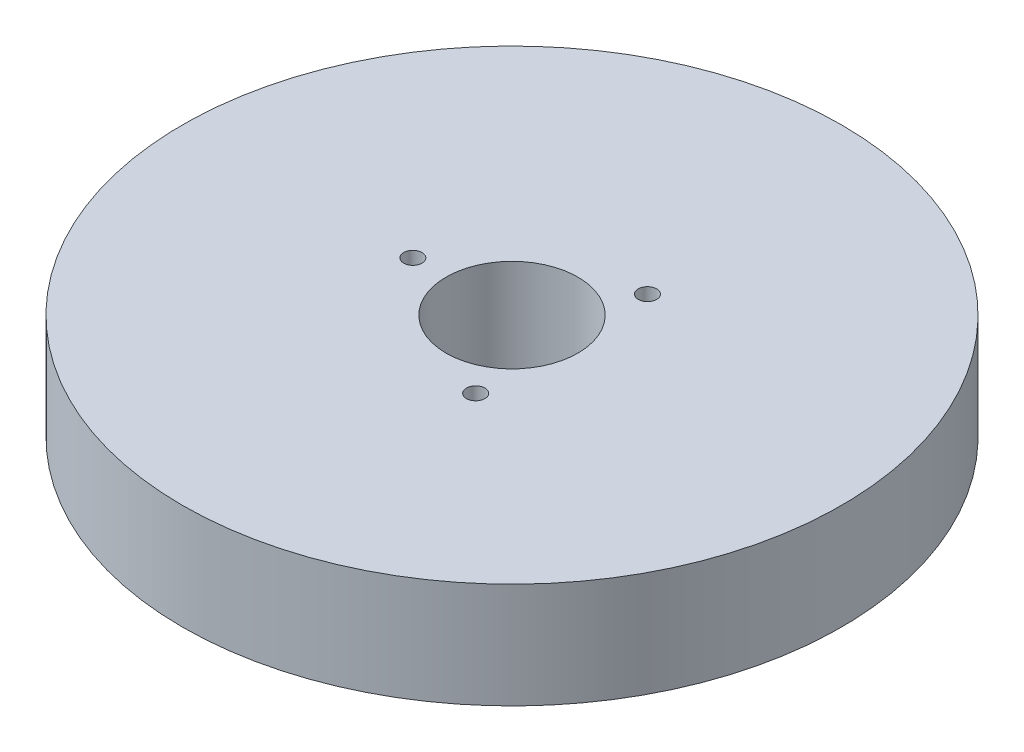
ISO-10303-21;
HEADER;
FILE_DESCRIPTION(('STEP AP214'),'2;1');
FILE_NAME('part.step','',(''),(''),'','','');
FILE_SCHEMA(('AUTOMOTIVE_DESIGN { 1 0 10303 214 1 1 1 1 }'));
ENDSEC;
DATA;
#1=APPLICATION_CONTEXT('core data for automotive mechanical design processes');
#2=APPLICATION_PROTOCOL_DEFINITION('international standard','automotive_design',2000,#1);
#3=PRODUCT_CONTEXT('',#1,'mechanical');
#4=PRODUCT('Part','Part','',(#3));
#5=PRODUCT_RELATED_PRODUCT_CATEGORY('part','',(#4));
#6=PRODUCT_DEFINITION_FORMATION('','',#4);
#7=PRODUCT_DEFINITION_CONTEXT('part definition',#1,'design');
#8=PRODUCT_DEFINITION('design','',#6,#7);
#9=PRODUCT_DEFINITION_SHAPE('','',#8);
#10=(LENGTH_UNIT() NAMED_UNIT(*) SI_UNIT(.MILLI.,.METRE.));
#11=(NAMED_UNIT(*) PLANE_ANGLE_UNIT() SI_UNIT($,.RADIAN.));
#12=(NAMED_UNIT(*) SI_UNIT($,.STERADIAN.) SOLID_ANGLE_UNIT());
#13=UNCERTAINTY_MEASURE_WITH_UNIT(LENGTH_MEASURE(1.E-05),#10,'distance_accuracy_value','');
#14=(GEOMETRIC_REPRESENTATION_CONTEXT(3) GLOBAL_UNCERTAINTY_ASSIGNED_CONTEXT((#13)) GLOBAL_UNIT_ASSIGNED_CONTEXT((#10,
#11,#12)) REPRESENTATION_CONTEXT('',''));
#15=CARTESIAN_POINT('',(0.,0.,0.));
#16=DIRECTION('',(0.,0.,1.));
#17=DIRECTION('',(1.,0.,0.));
#18=AXIS2_PLACEMENT_3D('',#15,#16,#17);
#19=CARTESIAN_POINT('',(0.,24.,0.));
#20=DIRECTION('',(0.,-1.,0.));
#21=DIRECTION('',(0.,0.,-1.));
#22=AXIS2_PLACEMENT_3D('',#19,#20,#21);
#23=CYLINDRICAL_SURFACE('',#22,75.);
#24=CARTESIAN_POINT('',(0.,24.,0.));
#25=DIRECTION('',(0.,1.,0.));
#26=DIRECTION('',(0.,0.,1.));
#27=AXIS2_PLACEMENT_3D('',#24,#25,#26);
#28=CIRCLE('',#27,75.);
#29=CARTESIAN_POINT('',(0.,24.,75.));
#30=VERTEX_POINT('',#29);
#31=EDGE_CURVE('E10',#30,#30,#28,.T.);
#32=ORIENTED_EDGE('',*,*,#31,.F.);
#33=EDGE_LOOP('',(#32));
#34=FACE_BOUND('',#33,.T.);
#35=CARTESIAN_POINT('',(0.,0.,0.));
#36=DIRECTION('',(0.,1.,0.));
#37=DIRECTION('',(0.,0.,1.));
#38=AXIS2_PLACEMENT_3D('',#35,#36,#37);
#39=CIRCLE('',#38,75.);
#40=CARTESIAN_POINT('',(0.,0.,75.));
#41=VERTEX_POINT('',#40);
#42=EDGE_CURVE('E37',#41,#41,#39,.T.);
#43=ORIENTED_EDGE('',*,*,#42,.T.);
#44=EDGE_LOOP('',(#43));
#45=FACE_BOUND('',#44,.T.);
#46=ADVANCED_FACE('F40',(#34,#45),#23,.T.);
#47=CARTESIAN_POINT('',(0.,24.,0.));
#48=DIRECTION('',(0.,1.,0.));
#49=DIRECTION('',(0.,0.,1.));
#50=AXIS2_PLACEMENT_3D('',#47,#48,#49);
#51=PLANE('',#50);
#52=CARTESIAN_POINT('',(11.2831409516372,24.,19.5429733971964));
#53=DIRECTION('',(0.,1.,0.));
#54=DIRECTION('',(0.866025403784436,0.,-0.500000000000004));
#55=AXIS2_PLACEMENT_3D('',#52,#53,#54);
#56=CIRCLE('',#55,2.09341307347147);
#57=CARTESIAN_POINT('',(13.0960898538779,24.,18.4962668604607));
#58=VERTEX_POINT('',#57);
#59=EDGE_CURVE('E70',#58,#58,#56,.T.);
#60=ORIENTED_EDGE('',*,*,#59,.F.);
#61=EDGE_LOOP('',(#60));
#62=FACE_BOUND('',#61,.T.);
#63=CARTESIAN_POINT('',(11.2831409516369,24.,-19.5429733971966));
#64=DIRECTION('',(0.,1.,0.));
#65=DIRECTION('',(-0.866025403784443,0.,-0.499999999999992));
#66=AXIS2_PLACEMENT_3D('',#63,#64,#65);
#67=CIRCLE('',#66,2.09341307347147);
#68=CARTESIAN_POINT('',(9.47019204939613,24.,-20.5896799339323));
#69=VERTEX_POINT('',#68);
#70=EDGE_CURVE('E61',#69,#69,#67,.T.);
#71=ORIENTED_EDGE('',*,*,#70,.F.);
#72=EDGE_LOOP('',(#71));
#73=FACE_BOUND('',#72,.T.);
#74=CARTESIAN_POINT('',(-22.5662819032742,24.,0.));
#75=DIRECTION('',(0.,1.,0.));
#76=DIRECTION('',(0.,0.,1.));
#77=AXIS2_PLACEMENT_3D('',#74,#75,#76);
#78=CIRCLE('',#77,2.09341307347147);
#79=CARTESIAN_POINT('',(-22.5662819032742,24.,2.09341307347147));
#80=VERTEX_POINT('',#79);
#81=EDGE_CURVE('E54',#80,#80,#78,.T.);
#82=ORIENTED_EDGE('',*,*,#81,.F.);
#83=EDGE_LOOP('',(#82));
#84=FACE_BOUND('',#83,.T.);
#85=CARTESIAN_POINT('',(0.,24.,0.));
#86=DIRECTION('',(0.,1.,0.));
#87=DIRECTION('',(0.,0.,1.));
#88=AXIS2_PLACEMENT_3D('',#85,#86,#87);
#89=CIRCLE('',#88,15.);
#90=CARTESIAN_POINT('',(0.,24.,15.));
#91=VERTEX_POINT('',#90);
#92=EDGE_CURVE('E50',#91,#91,#89,.T.);
#93=ORIENTED_EDGE('',*,*,#92,.F.);
#94=EDGE_LOOP('',(#93));
#95=FACE_BOUND('',#94,.T.);
#96=ORIENTED_EDGE('',*,*,#31,.T.);
#97=EDGE_LOOP('',(#96));
#98=FACE_BOUND('',#97,.T.);
#99=ADVANCED_FACE('F85',(#62,#73,#84,#95,#98),#51,.T.);
#100=CARTESIAN_POINT('',(0.,0.,0.));
#101=DIRECTION('',(0.,1.,0.));
#102=DIRECTION('',(0.,0.,1.));
#103=AXIS2_PLACEMENT_3D('',#100,#101,#102);
#104=PLANE('',#103);
#105=CARTESIAN_POINT('',(0.,0.,0.));
#106=DIRECTION('',(0.,1.,0.));
#107=DIRECTION('',(0.,0.,1.));
#108=AXIS2_PLACEMENT_3D('',#105,#106,#107);
#109=CIRCLE('',#108,15.);
#110=CARTESIAN_POINT('',(0.,0.,15.));
#111=VERTEX_POINT('',#110);
#112=EDGE_CURVE('E47',#111,#111,#109,.T.);
#113=ORIENTED_EDGE('',*,*,#112,.T.);
#114=EDGE_LOOP('',(#113));
#115=FACE_BOUND('',#114,.T.);
#116=ORIENTED_EDGE('',*,*,#42,.F.);
#117=EDGE_LOOP('',(#116));
#118=FACE_BOUND('',#117,.T.);
#119=ADVANCED_FACE('F84',(#115,#118),#104,.F.);
#120=CARTESIAN_POINT('',(0.,24.,0.));
#121=DIRECTION('',(0.,-1.,0.));
#122=DIRECTION('',(0.,0.,-1.));
#123=AXIS2_PLACEMENT_3D('',#120,#121,#122);
#124=CYLINDRICAL_SURFACE('',#123,15.);
#125=ORIENTED_EDGE('',*,*,#92,.T.);
#126=EDGE_LOOP('',(#125));
#127=FACE_BOUND('',#126,.T.);
#128=ORIENTED_EDGE('',*,*,#112,.F.);
#129=EDGE_LOOP('',(#128));
#130=FACE_BOUND('',#129,.T.);
#131=ADVANCED_FACE('F91',(#127,#130),#124,.F.);
#132=CARTESIAN_POINT('',(-22.5662819032742,1.57811360653181,0.));
#133=DIRECTION('',(0.,1.,0.));
#134=DIRECTION('',(0.,0.,1.));
#135=AXIS2_PLACEMENT_3D('',#132,#133,#134);
#136=CYLINDRICAL_SURFACE('',#135,2.09341307347147);
#137=CARTESIAN_POINT('',(-22.5662819032742,1.57811360653181,0.));
#138=DIRECTION('',(0.,1.,0.));
#139=DIRECTION('',(0.,0.,1.));
#140=AXIS2_PLACEMENT_3D('',#137,#138,#139);
#141=CIRCLE('',#140,2.09341307347147);
#142=CARTESIAN_POINT('',(-22.5662819032742,1.57811360653181,2.09341307347147));
#143=VERTEX_POINT('',#142);
#144=EDGE_CURVE('E55',#143,#143,#141,.T.);
#145=ORIENTED_EDGE('',*,*,#144,.F.);
#146=EDGE_LOOP('',(#145));
#147=FACE_BOUND('',#146,.T.);
#148=ORIENTED_EDGE('',*,*,#81,.T.);
#149=EDGE_LOOP('',(#148));
#150=FACE_BOUND('',#149,.T.);
#151=ADVANCED_FACE('F96',(#147,#150),#136,.F.);
#152=CARTESIAN_POINT('',(-22.5662819032742,1.57811360653181,0.));
#153=DIRECTION('',(0.,1.,0.));
#154=DIRECTION('',(0.,0.,1.));
#155=AXIS2_PLACEMENT_3D('',#152,#153,#154);
#156=PLANE('',#155);
#157=ORIENTED_EDGE('',*,*,#144,.T.);
#158=EDGE_LOOP('',(#157));
#159=FACE_BOUND('',#158,.T.);
#160=ADVANCED_FACE('F127',(#159),#156,.T.);
#161=CARTESIAN_POINT('',(11.2831409516369,1.57811360653181,-19.5429733971966));
#162=DIRECTION('',(0.,1.,0.));
#163=DIRECTION('',(0.,0.,1.));
#164=AXIS2_PLACEMENT_3D('',#161,#162,#163);
#165=CYLINDRICAL_SURFACE('',#164,2.09341307347147);
#166=CARTESIAN_POINT('',(11.2831409516369,1.57811360653181,-19.5429733971966));
#167=DIRECTION('',(0.,1.,0.));
#168=DIRECTION('',(-0.866025403784443,0.,-0.499999999999992));
#169=AXIS2_PLACEMENT_3D('',#166,#167,#168);
#170=CIRCLE('',#169,2.09341307347147);
#171=CARTESIAN_POINT('',(9.47019204939613,1.57811360653181,-20.5896799339323));
#172=VERTEX_POINT('',#171);
#173=EDGE_CURVE('E63',#172,#172,#170,.T.);
#174=ORIENTED_EDGE('',*,*,#173,.F.);
#175=EDGE_LOOP('',(#174));
#176=FACE_BOUND('',#175,.T.);
#177=ORIENTED_EDGE('',*,*,#70,.T.);
#178=EDGE_LOOP('',(#177));
#179=FACE_BOUND('',#178,.T.);
#180=ADVANCED_FACE('F133',(#176,#179),#165,.F.);
#181=CARTESIAN_POINT('',(11.2831409516369,1.57811360653181,-19.5429733971966));
#182=DIRECTION('',(0.,1.,0.));
#183=DIRECTION('',(-0.866025403784443,0.,-0.499999999999992));
#184=AXIS2_PLACEMENT_3D('',#181,#182,#183);
#185=PLANE('',#184);
#186=ORIENTED_EDGE('',*,*,#173,.T.);
#187=EDGE_LOOP('',(#186));
#188=FACE_BOUND('',#187,.T.);
#189=ADVANCED_FACE('F77',(#188),#185,.T.);
#190=CARTESIAN_POINT('',(11.2831409516372,1.57811360653181,19.5429733971964));
#191=DIRECTION('',(0.,1.,0.));
#192=DIRECTION('',(0.,0.,1.));
#193=AXIS2_PLACEMENT_3D('',#190,#191,#192);
#194=CYLINDRICAL_SURFACE('',#193,2.09341307347147);
#195=CARTESIAN_POINT('',(11.2831409516372,1.57811360653181,19.5429733971964));
#196=DIRECTION('',(0.,1.,0.));
#197=DIRECTION('',(0.866025403784436,0.,-0.500000000000004));
#198=AXIS2_PLACEMENT_3D('',#195,#196,#197);
#199=CIRCLE('',#198,2.09341307347147);
#200=CARTESIAN_POINT('',(13.0960898538779,1.57811360653181,18.4962668604607));
#201=VERTEX_POINT('',#200);
#202=EDGE_CURVE('E59',#201,#201,#199,.T.);
#203=ORIENTED_EDGE('',*,*,#202,.F.);
#204=EDGE_LOOP('',(#203));
#205=FACE_BOUND('',#204,.T.);
#206=ORIENTED_EDGE('',*,*,#59,.T.);
#207=EDGE_LOOP('',(#206));
#208=FACE_BOUND('',#207,.T.);
#209=ADVANCED_FACE('F73',(#205,#208),#194,.F.);
#210=CARTESIAN_POINT('',(11.2831409516372,1.57811360653181,19.5429733971964));
#211=DIRECTION('',(0.,1.,0.));
#212=DIRECTION('',(0.866025403784436,0.,-0.500000000000004));
#213=AXIS2_PLACEMENT_3D('',#210,#211,#212);
#214=PLANE('',#213);
#215=ORIENTED_EDGE('',*,*,#202,.T.);
#216=EDGE_LOOP('',(#215));
#217=FACE_BOUND('',#216,.T.);
#218=ADVANCED_FACE('F71',(#217),#214,.T.);
#219=CLOSED_SHELL('',(#46,#99,#119,#131,#151,#160,#180,#189,#209,#218));
#220=MANIFOLD_SOLID_BREP('B2',#219);
#221=ADVANCED_BREP_SHAPE_REPRESENTATION('',(#18,#220),#14);
#222=SHAPE_DEFINITION_REPRESENTATION(#9,#221);
ENDSEC;
END-ISO-10303-21;
